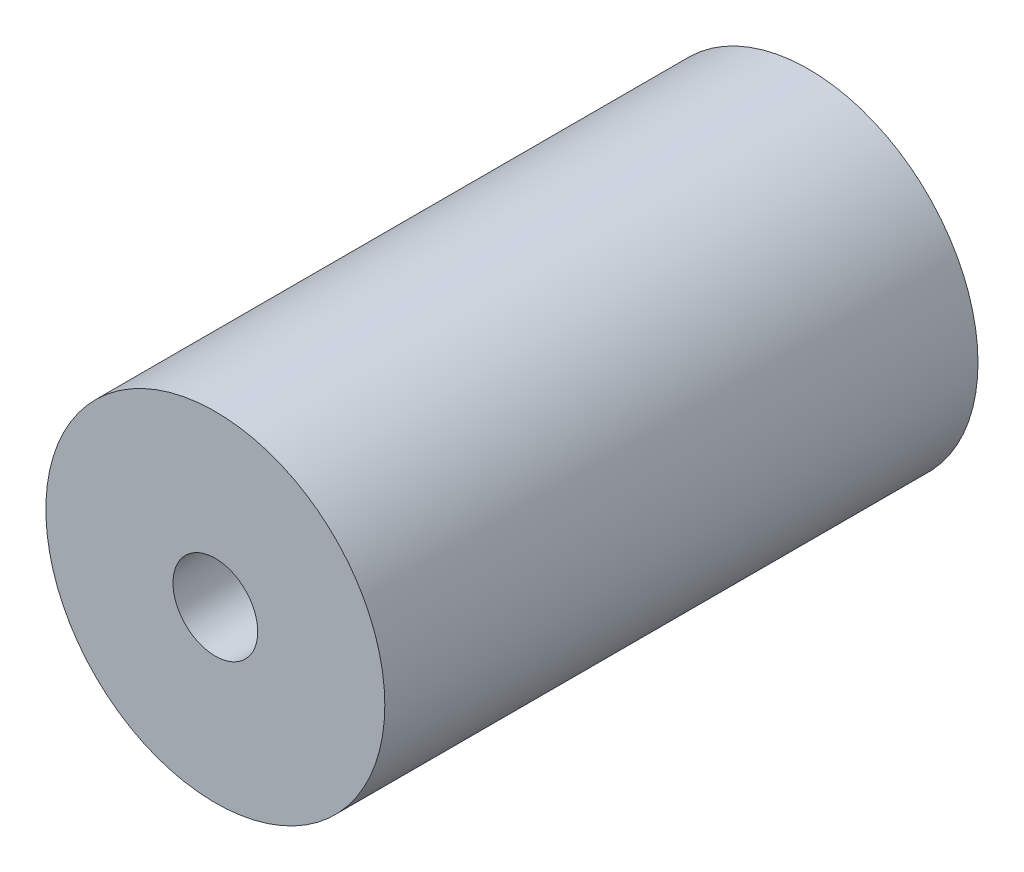
ISO-10303-21;
HEADER;
FILE_DESCRIPTION(('STEP AP214'),'2;1');
FILE_NAME('part.step','',(''),(''),'','','');
FILE_SCHEMA(('AUTOMOTIVE_DESIGN { 1 0 10303 214 1 1 1 1 }'));
ENDSEC;
DATA;
#1=APPLICATION_CONTEXT('core data for automotive mechanical design processes');
#2=APPLICATION_PROTOCOL_DEFINITION('international standard','automotive_design',2000,#1);
#3=PRODUCT_CONTEXT('',#1,'mechanical');
#4=PRODUCT('Part','Part','',(#3));
#5=PRODUCT_RELATED_PRODUCT_CATEGORY('part','',(#4));
#6=PRODUCT_DEFINITION_FORMATION('','',#4);
#7=PRODUCT_DEFINITION_CONTEXT('part definition',#1,'design');
#8=PRODUCT_DEFINITION('design','',#6,#7);
#9=PRODUCT_DEFINITION_SHAPE('','',#8);
#10=(LENGTH_UNIT() NAMED_UNIT(*) SI_UNIT(.MILLI.,.METRE.));
#11=(NAMED_UNIT(*) PLANE_ANGLE_UNIT() SI_UNIT($,.RADIAN.));
#12=(NAMED_UNIT(*) SI_UNIT($,.STERADIAN.) SOLID_ANGLE_UNIT());
#13=UNCERTAINTY_MEASURE_WITH_UNIT(LENGTH_MEASURE(1.E-05),#10,'distance_accuracy_value','');
#14=(GEOMETRIC_REPRESENTATION_CONTEXT(3) GLOBAL_UNCERTAINTY_ASSIGNED_CONTEXT((#13)) GLOBAL_UNIT_ASSIGNED_CONTEXT((#10,
#11,#12)) REPRESENTATION_CONTEXT('',''));
#15=CARTESIAN_POINT('',(0.,0.,0.));
#16=DIRECTION('',(0.,0.,1.));
#17=DIRECTION('',(1.,0.,0.));
#18=AXIS2_PLACEMENT_3D('',#15,#16,#17);
#19=CARTESIAN_POINT('',(0.,0.,17.5));
#20=DIRECTION('',(0.,0.,1.));
#21=DIRECTION('',(1.,0.,0.));
#22=AXIS2_PLACEMENT_3D('',#19,#20,#21);
#23=PLANE('',#22);
#24=CARTESIAN_POINT('',(0.,0.,17.5));
#25=DIRECTION('',(0.,0.,1.));
#26=DIRECTION('',(1.,0.,0.));
#27=AXIS2_PLACEMENT_3D('',#24,#25,#26);
#28=CIRCLE('',#27,10.);
#29=CARTESIAN_POINT('',(10.,0.,17.5));
#30=VERTEX_POINT('',#29);
#31=EDGE_CURVE('E10',#30,#30,#28,.T.);
#32=ORIENTED_EDGE('',*,*,#31,.T.);
#33=EDGE_LOOP('',(#32));
#34=FACE_BOUND('',#33,.T.);
#35=CARTESIAN_POINT('',(0.,0.,17.5));
#36=DIRECTION('',(0.,0.,1.));
#37=DIRECTION('',(1.,0.,0.));
#38=AXIS2_PLACEMENT_3D('',#35,#36,#37);
#39=CIRCLE('',#38,2.5);
#40=CARTESIAN_POINT('',(2.5,0.,17.5));
#41=VERTEX_POINT('',#40);
#42=EDGE_CURVE('E50',#41,#41,#39,.T.);
#43=ORIENTED_EDGE('',*,*,#42,.F.);
#44=EDGE_LOOP('',(#43));
#45=FACE_BOUND('',#44,.T.);
#46=ADVANCED_FACE('F37',(#34,#45),#23,.T.);
#47=CARTESIAN_POINT('',(0.,0.,-17.5));
#48=DIRECTION('',(0.,0.,1.));
#49=DIRECTION('',(1.,0.,0.));
#50=AXIS2_PLACEMENT_3D('',#47,#48,#49);
#51=PLANE('',#50);
#52=CARTESIAN_POINT('',(0.,0.,-17.5));
#53=DIRECTION('',(0.,0.,1.));
#54=DIRECTION('',(1.,0.,0.));
#55=AXIS2_PLACEMENT_3D('',#52,#53,#54);
#56=CIRCLE('',#55,10.);
#57=CARTESIAN_POINT('',(10.,0.,-17.5));
#58=VERTEX_POINT('',#57);
#59=EDGE_CURVE('E41',#58,#58,#56,.T.);
#60=ORIENTED_EDGE('',*,*,#59,.F.);
#61=EDGE_LOOP('',(#60));
#62=FACE_BOUND('',#61,.T.);
#63=CARTESIAN_POINT('',(0.,0.,-17.5));
#64=DIRECTION('',(0.,0.,1.));
#65=DIRECTION('',(1.,0.,0.));
#66=AXIS2_PLACEMENT_3D('',#63,#64,#65);
#67=CIRCLE('',#66,2.5);
#68=CARTESIAN_POINT('',(2.5,0.,-17.5));
#69=VERTEX_POINT('',#68);
#70=EDGE_CURVE('E52',#69,#69,#67,.T.);
#71=ORIENTED_EDGE('',*,*,#70,.T.);
#72=EDGE_LOOP('',(#71));
#73=FACE_BOUND('',#72,.T.);
#74=ADVANCED_FACE('F64',(#62,#73),#51,.F.);
#75=CARTESIAN_POINT('',(0.,0.,17.5));
#76=DIRECTION('',(0.,0.,-1.));
#77=DIRECTION('',(-1.,0.,0.));
#78=AXIS2_PLACEMENT_3D('',#75,#76,#77);
#79=CYLINDRICAL_SURFACE('',#78,10.);
#80=ORIENTED_EDGE('',*,*,#31,.F.);
#81=EDGE_LOOP('',(#80));
#82=FACE_BOUND('',#81,.T.);
#83=ORIENTED_EDGE('',*,*,#59,.T.);
#84=EDGE_LOOP('',(#83));
#85=FACE_BOUND('',#84,.T.);
#86=ADVANCED_FACE('F39',(#82,#85),#79,.T.);
#87=CARTESIAN_POINT('',(0.,0.,17.5));
#88=DIRECTION('',(0.,0.,-1.));
#89=DIRECTION('',(-1.,0.,0.));
#90=AXIS2_PLACEMENT_3D('',#87,#88,#89);
#91=CYLINDRICAL_SURFACE('',#90,2.5);
#92=ORIENTED_EDGE('',*,*,#42,.T.);
#93=EDGE_LOOP('',(#92));
#94=FACE_BOUND('',#93,.T.);
#95=ORIENTED_EDGE('',*,*,#70,.F.);
#96=EDGE_LOOP('',(#95));
#97=FACE_BOUND('',#96,.T.);
#98=ADVANCED_FACE('F60',(#94,#97),#91,.F.);
#99=CLOSED_SHELL('',(#46,#74,#86,#98));
#100=MANIFOLD_SOLID_BREP('B2',#99);
#101=ADVANCED_BREP_SHAPE_REPRESENTATION('',(#18,#100),#14);
#102=SHAPE_DEFINITION_REPRESENTATION(#9,#101);
ENDSEC;
END-ISO-10303-21;
